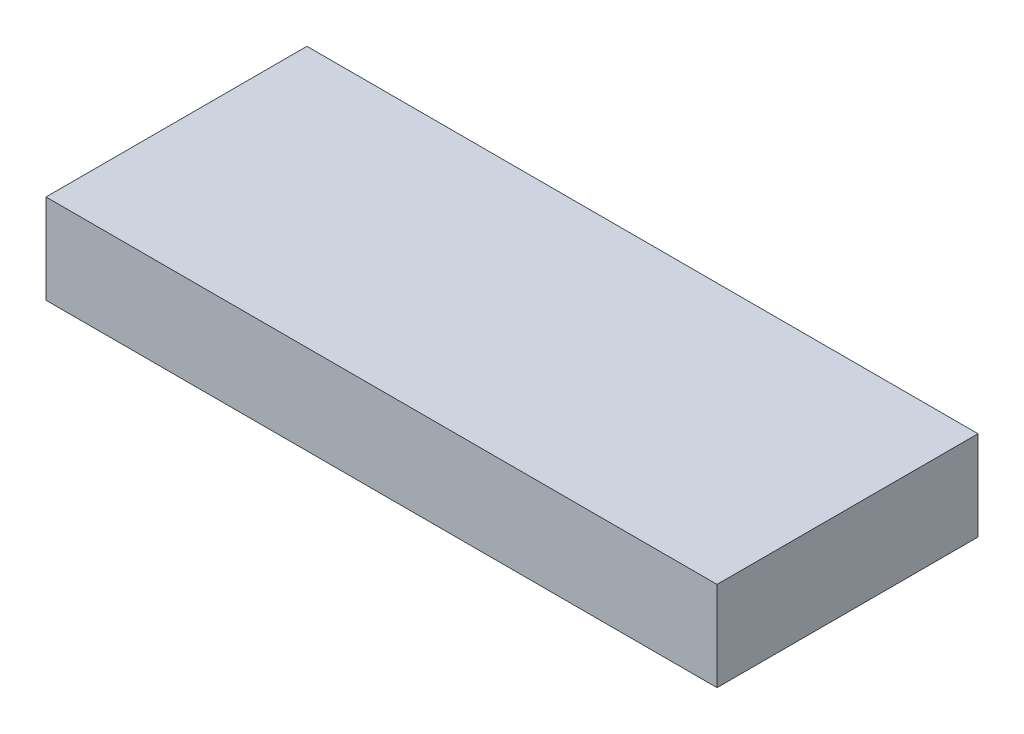
ISO-10303-21;
HEADER;
FILE_DESCRIPTION(('STEP AP214'),'2;1');
FILE_NAME('part.step','',(''),(''),'','','');
FILE_SCHEMA(('AUTOMOTIVE_DESIGN { 1 0 10303 214 1 1 1 1 }'));
ENDSEC;
DATA;
#1=APPLICATION_CONTEXT('core data for automotive mechanical design processes');
#2=APPLICATION_PROTOCOL_DEFINITION('international standard','automotive_design',2000,#1);
#3=PRODUCT_CONTEXT('',#1,'mechanical');
#4=PRODUCT('Part','Part','',(#3));
#5=PRODUCT_RELATED_PRODUCT_CATEGORY('part','',(#4));
#6=PRODUCT_DEFINITION_FORMATION('','',#4);
#7=PRODUCT_DEFINITION_CONTEXT('part definition',#1,'design');
#8=PRODUCT_DEFINITION('design','',#6,#7);
#9=PRODUCT_DEFINITION_SHAPE('','',#8);
#10=(LENGTH_UNIT() NAMED_UNIT(*) SI_UNIT(.MILLI.,.METRE.));
#11=(NAMED_UNIT(*) PLANE_ANGLE_UNIT() SI_UNIT($,.RADIAN.));
#12=(NAMED_UNIT(*) SI_UNIT($,.STERADIAN.) SOLID_ANGLE_UNIT());
#13=UNCERTAINTY_MEASURE_WITH_UNIT(LENGTH_MEASURE(1.E-05),#10,'distance_accuracy_value','');
#14=(GEOMETRIC_REPRESENTATION_CONTEXT(3) GLOBAL_UNCERTAINTY_ASSIGNED_CONTEXT((#13)) GLOBAL_UNIT_ASSIGNED_CONTEXT((#10,
#11,#12)) REPRESENTATION_CONTEXT('',''));
#15=CARTESIAN_POINT('',(0.,0.,0.));
#16=DIRECTION('',(0.,0.,1.));
#17=DIRECTION('',(1.,0.,0.));
#18=AXIS2_PLACEMENT_3D('',#15,#16,#17);
#19=CARTESIAN_POINT('',(-44.452358060598,12.,-68.4320297752371));
#20=DIRECTION('',(-1.,0.,0.));
#21=DIRECTION('',(0.,0.,1.));
#22=AXIS2_PLACEMENT_3D('',#19,#20,#21);
#23=PLANE('',#22);
#24=DIRECTION('',(0.,0.,-1.));
#25=VECTOR('',#24,1.);
#26=CARTESIAN_POINT('',(-44.452358060598,0.,-68.4320297752371));
#27=LINE('',#26,#25);
#28=CARTESIAN_POINT('',(-44.452358060598,0.,-33.4320297752371));
#29=VERTEX_POINT('',#28);
#30=CARTESIAN_POINT('',(-44.452358060598,0.,-68.4320297752371));
#31=VERTEX_POINT('',#30);
#32=EDGE_CURVE('E107',#29,#31,#27,.T.);
#33=ORIENTED_EDGE('',*,*,#32,.T.);
#34=DIRECTION('',(0.,-1.,0.));
#35=VECTOR('',#34,1.);
#36=CARTESIAN_POINT('',(-44.452358060598,12.,-68.4320297752371));
#37=LINE('',#36,#35);
#38=CARTESIAN_POINT('',(-44.452358060598,12.,-68.4320297752371));
#39=VERTEX_POINT('',#38);
#40=EDGE_CURVE('E11',#39,#31,#37,.T.);
#41=ORIENTED_EDGE('',*,*,#40,.F.);
#42=DIRECTION('',(0.,0.,-1.));
#43=VECTOR('',#42,1.);
#44=CARTESIAN_POINT('',(-44.452358060598,12.,-68.4320297752371));
#45=LINE('',#44,#43);
#46=CARTESIAN_POINT('',(-44.452358060598,12.,-33.4320297752371));
#47=VERTEX_POINT('',#46);
#48=EDGE_CURVE('E91',#47,#39,#45,.T.);
#49=ORIENTED_EDGE('',*,*,#48,.F.);
#50=DIRECTION('',(0.,-1.,0.));
#51=VECTOR('',#50,1.);
#52=CARTESIAN_POINT('',(-44.452358060598,12.,-33.4320297752371));
#53=LINE('',#52,#51);
#54=EDGE_CURVE('E103',#47,#29,#53,.T.);
#55=ORIENTED_EDGE('',*,*,#54,.T.);
#56=EDGE_LOOP('',(#33,#41,#49,#55));
#57=FACE_BOUND('',#56,.T.);
#58=ADVANCED_FACE('F39',(#57),#23,.F.);
#59=CARTESIAN_POINT('',(-134.452358060598,12.,-68.4320297752371));
#60=DIRECTION('',(0.,0.,1.));
#61=DIRECTION('',(1.,0.,0.));
#62=AXIS2_PLACEMENT_3D('',#59,#60,#61);
#63=PLANE('',#62);
#64=DIRECTION('',(-1.,0.,0.));
#65=VECTOR('',#64,1.);
#66=CARTESIAN_POINT('',(-134.452358060598,0.,-68.4320297752371));
#67=LINE('',#66,#65);
#68=CARTESIAN_POINT('',(-134.452358060598,0.,-68.4320297752371));
#69=VERTEX_POINT('',#68);
#70=EDGE_CURVE('E96',#31,#69,#67,.T.);
#71=ORIENTED_EDGE('',*,*,#70,.T.);
#72=DIRECTION('',(0.,-1.,0.));
#73=VECTOR('',#72,1.);
#74=CARTESIAN_POINT('',(-134.452358060598,12.,-68.4320297752371));
#75=LINE('',#74,#73);
#76=CARTESIAN_POINT('',(-134.452358060598,12.,-68.4320297752371));
#77=VERTEX_POINT('',#76);
#78=EDGE_CURVE('E48',#77,#69,#75,.T.);
#79=ORIENTED_EDGE('',*,*,#78,.F.);
#80=DIRECTION('',(-1.,0.,0.));
#81=VECTOR('',#80,1.);
#82=CARTESIAN_POINT('',(-134.452358060598,12.,-68.4320297752371));
#83=LINE('',#82,#81);
#84=EDGE_CURVE('E86',#39,#77,#83,.T.);
#85=ORIENTED_EDGE('',*,*,#84,.F.);
#86=ORIENTED_EDGE('',*,*,#40,.T.);
#87=EDGE_LOOP('',(#71,#79,#85,#86));
#88=FACE_BOUND('',#87,.T.);
#89=ADVANCED_FACE('F95',(#88),#63,.F.);
#90=CARTESIAN_POINT('',(-134.452358060598,12.,-68.4320297752371));
#91=DIRECTION('',(1.,0.,0.));
#92=DIRECTION('',(0.,0.,-1.));
#93=AXIS2_PLACEMENT_3D('',#90,#91,#92);
#94=PLANE('',#93);
#95=DIRECTION('',(0.,0.,1.));
#96=VECTOR('',#95,1.);
#97=CARTESIAN_POINT('',(-134.452358060598,0.,-68.4320297752371));
#98=LINE('',#97,#96);
#99=CARTESIAN_POINT('',(-134.452358060598,0.,-33.4320297752371));
#100=VERTEX_POINT('',#99);
#101=EDGE_CURVE('E73',#69,#100,#98,.T.);
#102=ORIENTED_EDGE('',*,*,#101,.T.);
#103=DIRECTION('',(0.,-1.,0.));
#104=VECTOR('',#103,1.);
#105=CARTESIAN_POINT('',(-134.452358060598,12.,-33.4320297752371));
#106=LINE('',#105,#104);
#107=CARTESIAN_POINT('',(-134.452358060598,12.,-33.4320297752371));
#108=VERTEX_POINT('',#107);
#109=EDGE_CURVE('E98',#108,#100,#106,.T.);
#110=ORIENTED_EDGE('',*,*,#109,.F.);
#111=DIRECTION('',(0.,0.,1.));
#112=VECTOR('',#111,1.);
#113=CARTESIAN_POINT('',(-134.452358060598,12.,-68.4320297752371));
#114=LINE('',#113,#112);
#115=EDGE_CURVE('E89',#77,#108,#114,.T.);
#116=ORIENTED_EDGE('',*,*,#115,.F.);
#117=ORIENTED_EDGE('',*,*,#78,.T.);
#118=EDGE_LOOP('',(#102,#110,#116,#117));
#119=FACE_BOUND('',#118,.T.);
#120=ADVANCED_FACE('F99',(#119),#94,.F.);
#121=CARTESIAN_POINT('',(-134.452358060598,12.,-33.4320297752371));
#122=DIRECTION('',(0.,0.,-1.));
#123=DIRECTION('',(-1.,0.,0.));
#124=AXIS2_PLACEMENT_3D('',#121,#122,#123);
#125=PLANE('',#124);
#126=DIRECTION('',(1.,0.,0.));
#127=VECTOR('',#126,1.);
#128=CARTESIAN_POINT('',(-134.452358060598,0.,-33.4320297752371));
#129=LINE('',#128,#127);
#130=EDGE_CURVE('E79',#100,#29,#129,.T.);
#131=ORIENTED_EDGE('',*,*,#130,.T.);
#132=ORIENTED_EDGE('',*,*,#54,.F.);
#133=DIRECTION('',(1.,0.,0.));
#134=VECTOR('',#133,1.);
#135=CARTESIAN_POINT('',(-134.452358060598,12.,-33.4320297752371));
#136=LINE('',#135,#134);
#137=EDGE_CURVE('E56',#108,#47,#136,.T.);
#138=ORIENTED_EDGE('',*,*,#137,.F.);
#139=ORIENTED_EDGE('',*,*,#109,.T.);
#140=EDGE_LOOP('',(#131,#132,#138,#139));
#141=FACE_BOUND('',#140,.T.);
#142=ADVANCED_FACE('F120',(#141),#125,.F.);
#143=CARTESIAN_POINT('',(0.,12.,0.));
#144=DIRECTION('',(0.,1.,0.));
#145=DIRECTION('',(0.,0.,1.));
#146=AXIS2_PLACEMENT_3D('',#143,#144,#145);
#147=PLANE('',#146);
#148=ORIENTED_EDGE('',*,*,#48,.T.);
#149=ORIENTED_EDGE('',*,*,#84,.T.);
#150=ORIENTED_EDGE('',*,*,#115,.T.);
#151=ORIENTED_EDGE('',*,*,#137,.T.);
#152=EDGE_LOOP('',(#148,#149,#150,#151));
#153=FACE_BOUND('',#152,.T.);
#154=ADVANCED_FACE('F87',(#153),#147,.T.);
#155=CARTESIAN_POINT('',(0.,0.,0.));
#156=DIRECTION('',(0.,1.,0.));
#157=DIRECTION('',(0.,0.,1.));
#158=AXIS2_PLACEMENT_3D('',#155,#156,#157);
#159=PLANE('',#158);
#160=ORIENTED_EDGE('',*,*,#32,.F.);
#161=ORIENTED_EDGE('',*,*,#130,.F.);
#162=ORIENTED_EDGE('',*,*,#101,.F.);
#163=ORIENTED_EDGE('',*,*,#70,.F.);
#164=EDGE_LOOP('',(#160,#161,#162,#163));
#165=FACE_BOUND('',#164,.T.);
#166=ADVANCED_FACE('F123',(#165),#159,.F.);
#167=CLOSED_SHELL('',(#58,#89,#120,#142,#154,#166));
#168=MANIFOLD_SOLID_BREP('B2',#167);
#169=ADVANCED_BREP_SHAPE_REPRESENTATION('',(#18,#168),#14);
#170=SHAPE_DEFINITION_REPRESENTATION(#9,#169);
ENDSEC;
END-ISO-10303-21;
